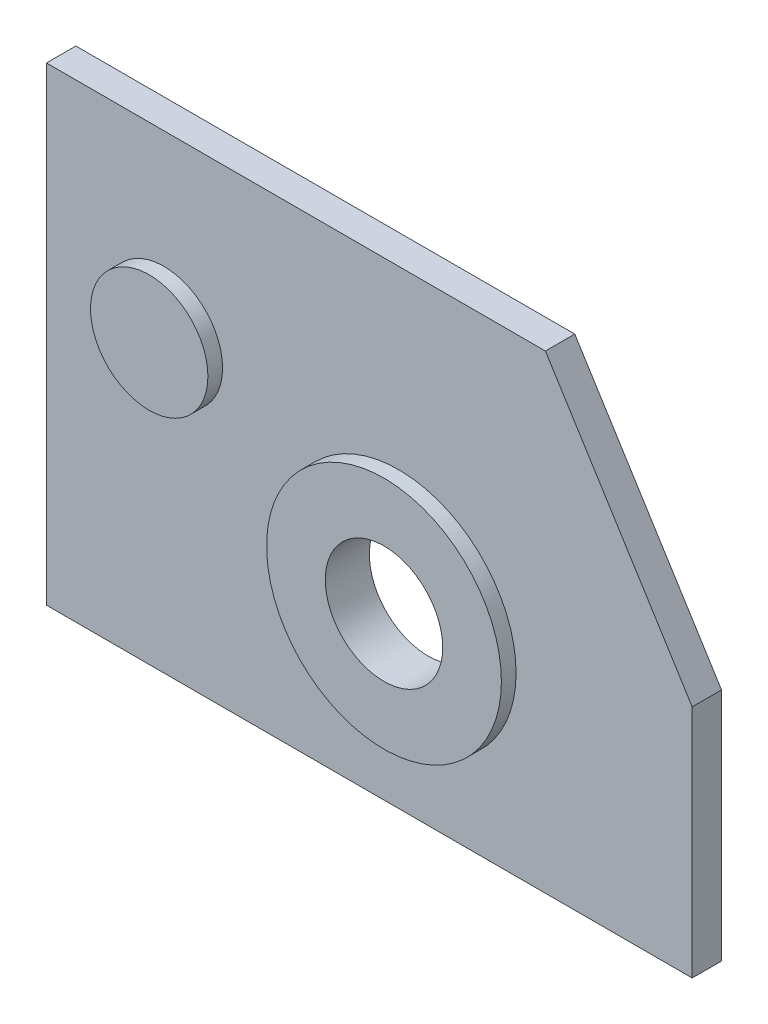
ISO-10303-21;
HEADER;
FILE_DESCRIPTION(('STEP AP214'),'2;1');
FILE_NAME('part.step','',(''),(''),'','','');
FILE_SCHEMA(('AUTOMOTIVE_DESIGN { 1 0 10303 214 1 1 1 1 }'));
ENDSEC;
DATA;
#1=APPLICATION_CONTEXT('core data for automotive mechanical design processes');
#2=APPLICATION_PROTOCOL_DEFINITION('international standard','automotive_design',2000,#1);
#3=PRODUCT_CONTEXT('',#1,'mechanical');
#4=PRODUCT('Part','Part','',(#3));
#5=PRODUCT_RELATED_PRODUCT_CATEGORY('part','',(#4));
#6=PRODUCT_DEFINITION_FORMATION('','',#4);
#7=PRODUCT_DEFINITION_CONTEXT('part definition',#1,'design');
#8=PRODUCT_DEFINITION('design','',#6,#7);
#9=PRODUCT_DEFINITION_SHAPE('','',#8);
#10=(LENGTH_UNIT() NAMED_UNIT(*) SI_UNIT(.MILLI.,.METRE.));
#11=(NAMED_UNIT(*) PLANE_ANGLE_UNIT() SI_UNIT($,.RADIAN.));
#12=(NAMED_UNIT(*) SI_UNIT($,.STERADIAN.) SOLID_ANGLE_UNIT());
#13=UNCERTAINTY_MEASURE_WITH_UNIT(LENGTH_MEASURE(1.E-05),#10,'distance_accuracy_value','');
#14=(GEOMETRIC_REPRESENTATION_CONTEXT(3) GLOBAL_UNCERTAINTY_ASSIGNED_CONTEXT((#13)) GLOBAL_UNIT_ASSIGNED_CONTEXT((#10,
#11,#12)) REPRESENTATION_CONTEXT('',''));
#15=CARTESIAN_POINT('',(0.,0.,0.));
#16=DIRECTION('',(0.,0.,1.));
#17=DIRECTION('',(1.,0.,0.));
#18=AXIS2_PLACEMENT_3D('',#15,#16,#17);
#19=CARTESIAN_POINT('',(0.,101.6,6.35));
#20=DIRECTION('',(1.,0.,0.));
#21=DIRECTION('',(0.,1.,0.));
#22=AXIS2_PLACEMENT_3D('',#19,#20,#21);
#23=PLANE('',#22);
#24=DIRECTION('',(0.,-1.,0.));
#25=VECTOR('',#24,1.);
#26=CARTESIAN_POINT('',(0.,101.6,0.));
#27=LINE('',#26,#25);
#28=CARTESIAN_POINT('',(0.,101.6,0.));
#29=VERTEX_POINT('',#28);
#30=CARTESIAN_POINT('',(0.,0.,0.));
#31=VERTEX_POINT('',#30);
#32=EDGE_CURVE('E107',#29,#31,#27,.T.);
#33=ORIENTED_EDGE('',*,*,#32,.T.);
#34=DIRECTION('',(0.,0.,-1.));
#35=VECTOR('',#34,1.);
#36=CARTESIAN_POINT('',(0.,0.,6.35));
#37=LINE('',#36,#35);
#38=CARTESIAN_POINT('',(0.,0.,6.35));
#39=VERTEX_POINT('',#38);
#40=EDGE_CURVE('E11',#39,#31,#37,.T.);
#41=ORIENTED_EDGE('',*,*,#40,.F.);
#42=DIRECTION('',(0.,-1.,0.));
#43=VECTOR('',#42,1.);
#44=CARTESIAN_POINT('',(0.,101.6,6.35));
#45=LINE('',#44,#43);
#46=CARTESIAN_POINT('',(0.,101.6,6.35));
#47=VERTEX_POINT('',#46);
#48=EDGE_CURVE('E116',#47,#39,#45,.T.);
#49=ORIENTED_EDGE('',*,*,#48,.F.);
#50=DIRECTION('',(0.,0.,-1.));
#51=VECTOR('',#50,1.);
#52=CARTESIAN_POINT('',(0.,101.6,6.35));
#53=LINE('',#52,#51);
#54=EDGE_CURVE('E103',#47,#29,#53,.T.);
#55=ORIENTED_EDGE('',*,*,#54,.T.);
#56=EDGE_LOOP('',(#33,#41,#49,#55));
#57=FACE_BOUND('',#56,.T.);
#58=ADVANCED_FACE('F32',(#57),#23,.F.);
#59=CARTESIAN_POINT('',(0.,0.,6.35));
#60=DIRECTION('',(0.,1.,0.));
#61=DIRECTION('',(0.,0.,1.));
#62=AXIS2_PLACEMENT_3D('',#59,#60,#61);
#63=PLANE('',#62);
#64=DIRECTION('',(1.,0.,0.));
#65=VECTOR('',#64,1.);
#66=CARTESIAN_POINT('',(0.,0.,0.));
#67=LINE('',#66,#65);
#68=CARTESIAN_POINT('',(139.7,0.,0.));
#69=VERTEX_POINT('',#68);
#70=EDGE_CURVE('E110',#31,#69,#67,.T.);
#71=ORIENTED_EDGE('',*,*,#70,.T.);
#72=DIRECTION('',(0.,0.,-1.));
#73=VECTOR('',#72,1.);
#74=CARTESIAN_POINT('',(139.7,0.,6.35));
#75=LINE('',#74,#73);
#76=CARTESIAN_POINT('',(139.7,0.,6.35));
#77=VERTEX_POINT('',#76);
#78=EDGE_CURVE('E41',#77,#69,#75,.T.);
#79=ORIENTED_EDGE('',*,*,#78,.F.);
#80=DIRECTION('',(1.,0.,0.));
#81=VECTOR('',#80,1.);
#82=CARTESIAN_POINT('',(0.,0.,6.35));
#83=LINE('',#82,#81);
#84=EDGE_CURVE('E83',#39,#77,#83,.T.);
#85=ORIENTED_EDGE('',*,*,#84,.F.);
#86=ORIENTED_EDGE('',*,*,#40,.T.);
#87=EDGE_LOOP('',(#71,#79,#85,#86));
#88=FACE_BOUND('',#87,.T.);
#89=ADVANCED_FACE('F137',(#88),#63,.F.);
#90=CARTESIAN_POINT('',(139.7,0.,6.35));
#91=DIRECTION('',(-1.,0.,0.));
#92=DIRECTION('',(0.,0.,1.));
#93=AXIS2_PLACEMENT_3D('',#90,#91,#92);
#94=PLANE('',#93);
#95=DIRECTION('',(0.,1.,0.));
#96=VECTOR('',#95,1.);
#97=CARTESIAN_POINT('',(139.7,0.,0.));
#98=LINE('',#97,#96);
#99=CARTESIAN_POINT('',(139.7,50.8,0.));
#100=VERTEX_POINT('',#99);
#101=EDGE_CURVE('E98',#69,#100,#98,.T.);
#102=ORIENTED_EDGE('',*,*,#101,.T.);
#103=DIRECTION('',(0.,0.,-1.));
#104=VECTOR('',#103,1.);
#105=CARTESIAN_POINT('',(139.7,50.8,6.35));
#106=LINE('',#105,#104);
#107=CARTESIAN_POINT('',(139.7,50.8,6.35));
#108=VERTEX_POINT('',#107);
#109=EDGE_CURVE('E95',#108,#100,#106,.T.);
#110=ORIENTED_EDGE('',*,*,#109,.F.);
#111=DIRECTION('',(0.,1.,0.));
#112=VECTOR('',#111,1.);
#113=CARTESIAN_POINT('',(139.7,0.,6.35));
#114=LINE('',#113,#112);
#115=EDGE_CURVE('E87',#77,#108,#114,.T.);
#116=ORIENTED_EDGE('',*,*,#115,.F.);
#117=ORIENTED_EDGE('',*,*,#78,.T.);
#118=EDGE_LOOP('',(#102,#110,#116,#117));
#119=FACE_BOUND('',#118,.T.);
#120=ADVANCED_FACE('F96',(#119),#94,.F.);
#121=CARTESIAN_POINT('',(139.7,50.8,6.35));
#122=DIRECTION('',(-0.847998304005088,-0.52999894000318,0.));
#123=DIRECTION('',(0.52999894000318,-0.847998304005088,0.));
#124=AXIS2_PLACEMENT_3D('',#121,#122,#123);
#125=PLANE('',#124);
#126=DIRECTION('',(-0.52999894000318,0.847998304005088,0.));
#127=VECTOR('',#126,1.);
#128=CARTESIAN_POINT('',(139.7,50.8,0.));
#129=LINE('',#128,#127);
#130=CARTESIAN_POINT('',(107.95,101.6,0.));
#131=VERTEX_POINT('',#130);
#132=EDGE_CURVE('E69',#100,#131,#129,.T.);
#133=ORIENTED_EDGE('',*,*,#132,.T.);
#134=DIRECTION('',(0.,0.,-1.));
#135=VECTOR('',#134,1.);
#136=CARTESIAN_POINT('',(107.95,101.6,6.35));
#137=LINE('',#136,#135);
#138=CARTESIAN_POINT('',(107.95,101.6,6.35));
#139=VERTEX_POINT('',#138);
#140=EDGE_CURVE('E99',#139,#131,#137,.T.);
#141=ORIENTED_EDGE('',*,*,#140,.F.);
#142=DIRECTION('',(-0.52999894000318,0.847998304005088,0.));
#143=VECTOR('',#142,1.);
#144=CARTESIAN_POINT('',(139.7,50.8,6.35));
#145=LINE('',#144,#143);
#146=EDGE_CURVE('E91',#108,#139,#145,.T.);
#147=ORIENTED_EDGE('',*,*,#146,.F.);
#148=ORIENTED_EDGE('',*,*,#109,.T.);
#149=EDGE_LOOP('',(#133,#141,#147,#148));
#150=FACE_BOUND('',#149,.T.);
#151=ADVANCED_FACE('F101',(#150),#125,.F.);
#152=CARTESIAN_POINT('',(107.95,101.6,6.35));
#153=DIRECTION('',(0.,-1.,0.));
#154=DIRECTION('',(0.,0.,-1.));
#155=AXIS2_PLACEMENT_3D('',#152,#153,#154);
#156=PLANE('',#155);
#157=DIRECTION('',(-1.,0.,0.));
#158=VECTOR('',#157,1.);
#159=CARTESIAN_POINT('',(107.95,101.6,0.));
#160=LINE('',#159,#158);
#161=EDGE_CURVE('E75',#131,#29,#160,.T.);
#162=ORIENTED_EDGE('',*,*,#161,.T.);
#163=ORIENTED_EDGE('',*,*,#54,.F.);
#164=DIRECTION('',(-1.,0.,0.));
#165=VECTOR('',#164,1.);
#166=CARTESIAN_POINT('',(107.95,101.6,6.35));
#167=LINE('',#166,#165);
#168=EDGE_CURVE('E49',#139,#47,#167,.T.);
#169=ORIENTED_EDGE('',*,*,#168,.F.);
#170=ORIENTED_EDGE('',*,*,#140,.T.);
#171=EDGE_LOOP('',(#162,#163,#169,#170));
#172=FACE_BOUND('',#171,.T.);
#173=ADVANCED_FACE('F125',(#172),#156,.F.);
#174=CARTESIAN_POINT('',(0.,0.,6.35));
#175=DIRECTION('',(0.,0.,1.));
#176=DIRECTION('',(1.,0.,0.));
#177=AXIS2_PLACEMENT_3D('',#174,#175,#176);
#178=PLANE('',#177);
#179=CARTESIAN_POINT('',(76.2,38.1,6.35));
#180=DIRECTION('',(0.,0.,1.));
#181=DIRECTION('',(1.,0.,0.));
#182=AXIS2_PLACEMENT_3D('',#179,#180,#181);
#183=CIRCLE('',#182,25.4);
#184=CARTESIAN_POINT('',(101.6,38.1,6.35));
#185=VERTEX_POINT('',#184);
#186=EDGE_CURVE('E232',#185,#185,#183,.T.);
#187=ORIENTED_EDGE('',*,*,#186,.F.);
#188=EDGE_LOOP('',(#187));
#189=FACE_BOUND('',#188,.T.);
#190=CARTESIAN_POINT('',(25.4,63.5,6.35));
#191=DIRECTION('',(0.,0.,1.));
#192=DIRECTION('',(1.,0.,0.));
#193=AXIS2_PLACEMENT_3D('',#190,#191,#192);
#194=CIRCLE('',#193,12.7);
#195=CARTESIAN_POINT('',(38.1,63.5,6.35));
#196=VERTEX_POINT('',#195);
#197=EDGE_CURVE('E239',#196,#196,#194,.T.);
#198=ORIENTED_EDGE('',*,*,#197,.F.);
#199=EDGE_LOOP('',(#198));
#200=FACE_BOUND('',#199,.T.);
#201=ORIENTED_EDGE('',*,*,#48,.T.);
#202=ORIENTED_EDGE('',*,*,#84,.T.);
#203=ORIENTED_EDGE('',*,*,#115,.T.);
#204=ORIENTED_EDGE('',*,*,#146,.T.);
#205=ORIENTED_EDGE('',*,*,#168,.T.);
#206=EDGE_LOOP('',(#201,#202,#203,#204,#205));
#207=FACE_BOUND('',#206,.T.);
#208=ADVANCED_FACE('F89',(#189,#200,#207),#178,.T.);
#209=CARTESIAN_POINT('',(0.,0.,0.));
#210=DIRECTION('',(0.,0.,1.));
#211=DIRECTION('',(1.,0.,0.));
#212=AXIS2_PLACEMENT_3D('',#209,#210,#211);
#213=PLANE('',#212);
#214=CARTESIAN_POINT('',(76.2,38.1,0.));
#215=DIRECTION('',(0.,0.,1.));
#216=DIRECTION('',(1.,0.,0.));
#217=AXIS2_PLACEMENT_3D('',#214,#215,#216);
#218=CIRCLE('',#217,12.7);
#219=CARTESIAN_POINT('',(88.9,38.1,0.));
#220=VERTEX_POINT('',#219);
#221=EDGE_CURVE('E35',#220,#220,#218,.T.);
#222=ORIENTED_EDGE('',*,*,#221,.T.);
#223=EDGE_LOOP('',(#222));
#224=FACE_BOUND('',#223,.T.);
#225=ORIENTED_EDGE('',*,*,#32,.F.);
#226=ORIENTED_EDGE('',*,*,#161,.F.);
#227=ORIENTED_EDGE('',*,*,#132,.F.);
#228=ORIENTED_EDGE('',*,*,#101,.F.);
#229=ORIENTED_EDGE('',*,*,#70,.F.);
#230=EDGE_LOOP('',(#225,#226,#227,#228,#229));
#231=FACE_BOUND('',#230,.T.);
#232=ADVANCED_FACE('F121',(#224,#231),#213,.F.);
#233=CARTESIAN_POINT('',(25.4,63.5,9.525));
#234=DIRECTION('',(0.,0.,-1.));
#235=DIRECTION('',(-1.,0.,0.));
#236=AXIS2_PLACEMENT_3D('',#233,#234,#235);
#237=CYLINDRICAL_SURFACE('',#236,12.7);
#238=CARTESIAN_POINT('',(25.4,63.5,9.525));
#239=DIRECTION('',(0.,0.,1.));
#240=DIRECTION('',(1.,0.,0.));
#241=AXIS2_PLACEMENT_3D('',#238,#239,#240);
#242=CIRCLE('',#241,12.7);
#243=CARTESIAN_POINT('',(38.1,63.5,9.525));
#244=VERTEX_POINT('',#243);
#245=EDGE_CURVE('E111',#244,#244,#242,.T.);
#246=ORIENTED_EDGE('',*,*,#245,.F.);
#247=EDGE_LOOP('',(#246));
#248=FACE_BOUND('',#247,.T.);
#249=ORIENTED_EDGE('',*,*,#197,.T.);
#250=EDGE_LOOP('',(#249));
#251=FACE_BOUND('',#250,.T.);
#252=ADVANCED_FACE('F168',(#248,#251),#237,.T.);
#253=CARTESIAN_POINT('',(25.4,63.5,9.525));
#254=DIRECTION('',(0.,0.,1.));
#255=DIRECTION('',(1.,0.,0.));
#256=AXIS2_PLACEMENT_3D('',#253,#254,#255);
#257=PLANE('',#256);
#258=ORIENTED_EDGE('',*,*,#245,.T.);
#259=EDGE_LOOP('',(#258));
#260=FACE_BOUND('',#259,.T.);
#261=ADVANCED_FACE('F173',(#260),#257,.T.);
#262=CARTESIAN_POINT('',(76.2,38.1,9.525));
#263=DIRECTION('',(0.,0.,1.));
#264=DIRECTION('',(1.,0.,0.));
#265=AXIS2_PLACEMENT_3D('',#262,#263,#264);
#266=PLANE('',#265);
#267=CARTESIAN_POINT('',(76.2,38.1,9.525));
#268=DIRECTION('',(0.,0.,1.));
#269=DIRECTION('',(1.,0.,0.));
#270=AXIS2_PLACEMENT_3D('',#267,#268,#269);
#271=CIRCLE('',#270,25.4);
#272=CARTESIAN_POINT('',(101.6,38.1,9.525));
#273=VERTEX_POINT('',#272);
#274=EDGE_CURVE('E235',#273,#273,#271,.T.);
#275=ORIENTED_EDGE('',*,*,#274,.T.);
#276=EDGE_LOOP('',(#275));
#277=FACE_BOUND('',#276,.T.);
#278=CARTESIAN_POINT('',(76.2,38.1,9.525));
#279=DIRECTION('',(0.,0.,1.));
#280=DIRECTION('',(1.,0.,0.));
#281=AXIS2_PLACEMENT_3D('',#278,#279,#280);
#282=CIRCLE('',#281,12.7);
#283=CARTESIAN_POINT('',(88.9,38.1,9.525));
#284=VERTEX_POINT('',#283);
#285=EDGE_CURVE('E229',#284,#284,#282,.T.);
#286=ORIENTED_EDGE('',*,*,#285,.F.);
#287=EDGE_LOOP('',(#286));
#288=FACE_BOUND('',#287,.T.);
#289=ADVANCED_FACE('F183',(#277,#288),#266,.T.);
#290=CARTESIAN_POINT('',(76.2,38.1,9.525));
#291=DIRECTION('',(0.,0.,-1.));
#292=DIRECTION('',(-1.,0.,0.));
#293=AXIS2_PLACEMENT_3D('',#290,#291,#292);
#294=CYLINDRICAL_SURFACE('',#293,25.4);
#295=ORIENTED_EDGE('',*,*,#274,.F.);
#296=EDGE_LOOP('',(#295));
#297=FACE_BOUND('',#296,.T.);
#298=ORIENTED_EDGE('',*,*,#186,.T.);
#299=EDGE_LOOP('',(#298));
#300=FACE_BOUND('',#299,.T.);
#301=ADVANCED_FACE('F193',(#297,#300),#294,.T.);
#302=CARTESIAN_POINT('',(76.2,38.1,9.525));
#303=DIRECTION('',(0.,0.,-1.));
#304=DIRECTION('',(-1.,0.,0.));
#305=AXIS2_PLACEMENT_3D('',#302,#303,#304);
#306=CYLINDRICAL_SURFACE('',#305,12.7);
#307=ORIENTED_EDGE('',*,*,#285,.T.);
#308=EDGE_LOOP('',(#307));
#309=FACE_BOUND('',#308,.T.);
#310=ORIENTED_EDGE('',*,*,#221,.F.);
#311=EDGE_LOOP('',(#310));
#312=FACE_BOUND('',#311,.T.);
#313=ADVANCED_FACE('F203',(#309,#312),#306,.F.);
#314=CLOSED_SHELL('',(#58,#89,#120,#151,#173,#208,#232,#252,#261,#289,#301,#313));
#315=MANIFOLD_SOLID_BREP('B2',#314);
#316=ADVANCED_BREP_SHAPE_REPRESENTATION('',(#18,#315),#14);
#317=SHAPE_DEFINITION_REPRESENTATION(#9,#316);
ENDSEC;
END-ISO-10303-21;
